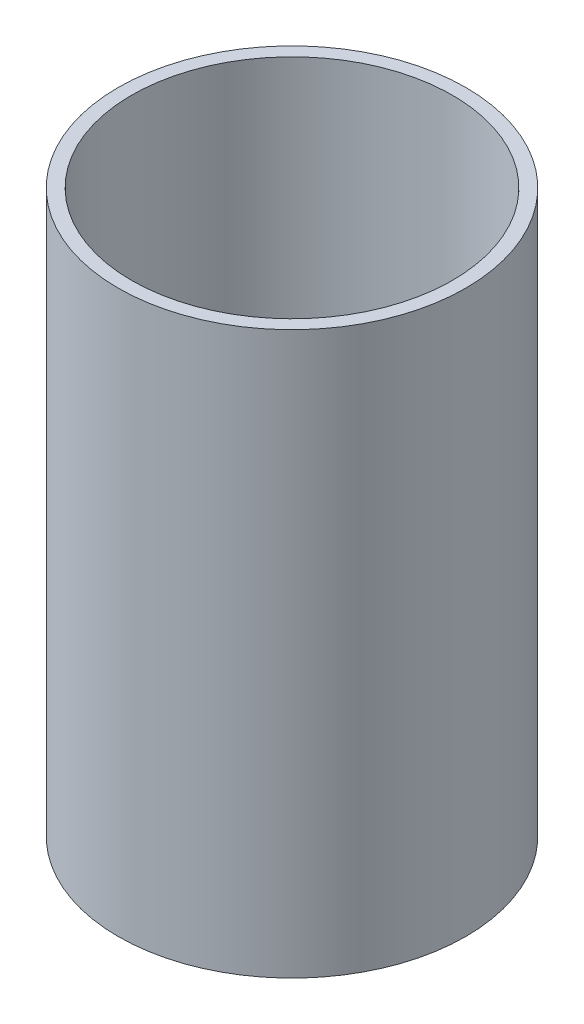
ISO-10303-21;
HEADER;
FILE_DESCRIPTION(('STEP AP214'),'2;1');
FILE_NAME('part.step','',(''),(''),'','','');
FILE_SCHEMA(('AUTOMOTIVE_DESIGN { 1 0 10303 214 1 1 1 1 }'));
ENDSEC;
DATA;
#1=APPLICATION_CONTEXT('core data for automotive mechanical design processes');
#2=APPLICATION_PROTOCOL_DEFINITION('international standard','automotive_design',2000,#1);
#3=PRODUCT_CONTEXT('',#1,'mechanical');
#4=PRODUCT('Part','Part','',(#3));
#5=PRODUCT_RELATED_PRODUCT_CATEGORY('part','',(#4));
#6=PRODUCT_DEFINITION_FORMATION('','',#4);
#7=PRODUCT_DEFINITION_CONTEXT('part definition',#1,'design');
#8=PRODUCT_DEFINITION('design','',#6,#7);
#9=PRODUCT_DEFINITION_SHAPE('','',#8);
#10=(LENGTH_UNIT() NAMED_UNIT(*) SI_UNIT(.MILLI.,.METRE.));
#11=(NAMED_UNIT(*) PLANE_ANGLE_UNIT() SI_UNIT($,.RADIAN.));
#12=(NAMED_UNIT(*) SI_UNIT($,.STERADIAN.) SOLID_ANGLE_UNIT());
#13=UNCERTAINTY_MEASURE_WITH_UNIT(LENGTH_MEASURE(1.E-05),#10,'distance_accuracy_value','');
#14=(GEOMETRIC_REPRESENTATION_CONTEXT(3) GLOBAL_UNCERTAINTY_ASSIGNED_CONTEXT((#13)) GLOBAL_UNIT_ASSIGNED_CONTEXT((#10,
#11,#12)) REPRESENTATION_CONTEXT('',''));
#15=CARTESIAN_POINT('',(0.,0.,0.));
#16=DIRECTION('',(0.,0.,1.));
#17=DIRECTION('',(1.,0.,0.));
#18=AXIS2_PLACEMENT_3D('',#15,#16,#17);
#19=CARTESIAN_POINT('',(0.,55.,0.));
#20=DIRECTION('',(0.,1.,0.));
#21=DIRECTION('',(0.,0.,1.));
#22=AXIS2_PLACEMENT_3D('',#19,#20,#21);
#23=CYLINDRICAL_SURFACE('',#22,41.275);
#24=CARTESIAN_POINT('',(0.,-133.35,0.));
#25=DIRECTION('',(0.,1.,0.));
#26=DIRECTION('',(0.,0.,1.));
#27=AXIS2_PLACEMENT_3D('',#24,#25,#26);
#28=CIRCLE('',#27,41.275);
#29=CARTESIAN_POINT('',(0.,-133.35,41.275));
#30=VERTEX_POINT('',#29);
#31=EDGE_CURVE('E10',#30,#30,#28,.T.);
#32=ORIENTED_EDGE('',*,*,#31,.T.);
#33=EDGE_LOOP('',(#32));
#34=FACE_BOUND('',#33,.T.);
#35=CARTESIAN_POINT('',(0.,0.,0.));
#36=DIRECTION('',(0.,1.,0.));
#37=DIRECTION('',(0.,0.,1.));
#38=AXIS2_PLACEMENT_3D('',#35,#36,#37);
#39=CIRCLE('',#38,41.275);
#40=CARTESIAN_POINT('',(0.,0.,41.275));
#41=VERTEX_POINT('',#40);
#42=EDGE_CURVE('E46',#41,#41,#39,.T.);
#43=ORIENTED_EDGE('',*,*,#42,.F.);
#44=EDGE_LOOP('',(#43));
#45=FACE_BOUND('',#44,.T.);
#46=ADVANCED_FACE('F32',(#34,#45),#23,.T.);
#47=CARTESIAN_POINT('',(-41.275,-133.35,0.));
#48=DIRECTION('',(0.,-1.,0.));
#49=DIRECTION('',(0.,0.,-1.));
#50=AXIS2_PLACEMENT_3D('',#47,#48,#49);
#51=PLANE('',#50);
#52=CARTESIAN_POINT('',(0.,-133.35,0.));
#53=DIRECTION('',(0.,1.,0.));
#54=DIRECTION('',(0.,0.,1.));
#55=AXIS2_PLACEMENT_3D('',#52,#53,#54);
#56=CIRCLE('',#55,38.1);
#57=CARTESIAN_POINT('',(0.,-133.35,38.1));
#58=VERTEX_POINT('',#57);
#59=EDGE_CURVE('E38',#58,#58,#56,.T.);
#60=ORIENTED_EDGE('',*,*,#59,.T.);
#61=EDGE_LOOP('',(#60));
#62=FACE_BOUND('',#61,.T.);
#63=ORIENTED_EDGE('',*,*,#31,.F.);
#64=EDGE_LOOP('',(#63));
#65=FACE_BOUND('',#64,.T.);
#66=ADVANCED_FACE('F56',(#62,#65),#51,.T.);
#67=CARTESIAN_POINT('',(0.,55.,0.));
#68=DIRECTION('',(0.,1.,0.));
#69=DIRECTION('',(0.,0.,1.));
#70=AXIS2_PLACEMENT_3D('',#67,#68,#69);
#71=CYLINDRICAL_SURFACE('',#70,38.1);
#72=CARTESIAN_POINT('',(0.,0.,0.));
#73=DIRECTION('',(0.,1.,0.));
#74=DIRECTION('',(0.,0.,1.));
#75=AXIS2_PLACEMENT_3D('',#72,#73,#74);
#76=CIRCLE('',#75,38.1);
#77=CARTESIAN_POINT('',(0.,0.,38.1));
#78=VERTEX_POINT('',#77);
#79=EDGE_CURVE('E42',#78,#78,#76,.T.);
#80=ORIENTED_EDGE('',*,*,#79,.T.);
#81=EDGE_LOOP('',(#80));
#82=FACE_BOUND('',#81,.T.);
#83=ORIENTED_EDGE('',*,*,#59,.F.);
#84=EDGE_LOOP('',(#83));
#85=FACE_BOUND('',#84,.T.);
#86=ADVANCED_FACE('F60',(#82,#85),#71,.F.);
#87=CARTESIAN_POINT('',(-41.275,0.,0.));
#88=DIRECTION('',(0.,1.,0.));
#89=DIRECTION('',(0.,0.,1.));
#90=AXIS2_PLACEMENT_3D('',#87,#88,#89);
#91=PLANE('',#90);
#92=ORIENTED_EDGE('',*,*,#42,.T.);
#93=EDGE_LOOP('',(#92));
#94=FACE_BOUND('',#93,.T.);
#95=ORIENTED_EDGE('',*,*,#79,.F.);
#96=EDGE_LOOP('',(#95));
#97=FACE_BOUND('',#96,.T.);
#98=ADVANCED_FACE('F52',(#94,#97),#91,.T.);
#99=CLOSED_SHELL('',(#46,#66,#86,#98));
#100=MANIFOLD_SOLID_BREP('B2',#99);
#101=ADVANCED_BREP_SHAPE_REPRESENTATION('',(#18,#100),#14);
#102=SHAPE_DEFINITION_REPRESENTATION(#9,#101);
ENDSEC;
END-ISO-10303-21;
